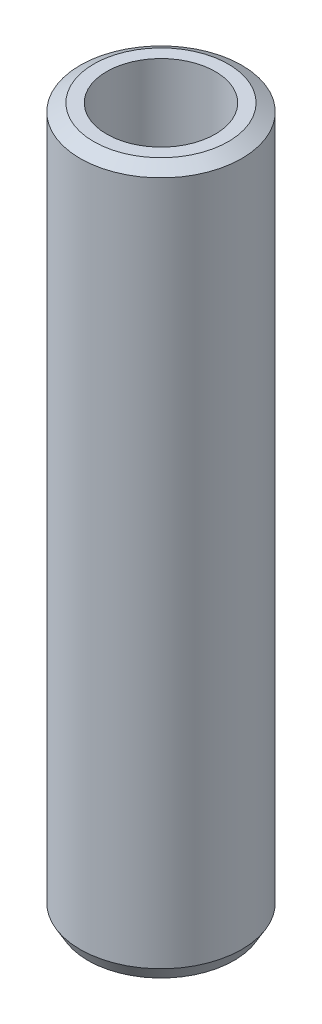
ISO-10303-21;
HEADER;
FILE_DESCRIPTION(('STEP AP214'),'2;1');
FILE_NAME('part.step','',(''),(''),'','','');
FILE_SCHEMA(('AUTOMOTIVE_DESIGN { 1 0 10303 214 1 1 1 1 }'));
ENDSEC;
DATA;
#1=APPLICATION_CONTEXT('core data for automotive mechanical design processes');
#2=APPLICATION_PROTOCOL_DEFINITION('international standard','automotive_design',2000,#1);
#3=PRODUCT_CONTEXT('',#1,'mechanical');
#4=PRODUCT('Part','Part','',(#3));
#5=PRODUCT_RELATED_PRODUCT_CATEGORY('part','',(#4));
#6=PRODUCT_DEFINITION_FORMATION('','',#4);
#7=PRODUCT_DEFINITION_CONTEXT('part definition',#1,'design');
#8=PRODUCT_DEFINITION('design','',#6,#7);
#9=PRODUCT_DEFINITION_SHAPE('','',#8);
#10=(LENGTH_UNIT() NAMED_UNIT(*) SI_UNIT(.MILLI.,.METRE.));
#11=(NAMED_UNIT(*) PLANE_ANGLE_UNIT() SI_UNIT($,.RADIAN.));
#12=(NAMED_UNIT(*) SI_UNIT($,.STERADIAN.) SOLID_ANGLE_UNIT());
#13=UNCERTAINTY_MEASURE_WITH_UNIT(LENGTH_MEASURE(1.E-05),#10,'distance_accuracy_value','');
#14=(GEOMETRIC_REPRESENTATION_CONTEXT(3) GLOBAL_UNCERTAINTY_ASSIGNED_CONTEXT((#13)) GLOBAL_UNIT_ASSIGNED_CONTEXT((#10,
#11,#12)) REPRESENTATION_CONTEXT('',''));
#15=CARTESIAN_POINT('',(0.,0.,0.));
#16=DIRECTION('',(0.,0.,1.));
#17=DIRECTION('',(1.,0.,0.));
#18=AXIS2_PLACEMENT_3D('',#15,#16,#17);
#19=CARTESIAN_POINT('',(0.,109.249292653029,0.));
#20=DIRECTION('',(0.,-1.,0.));
#21=DIRECTION('',(0.,0.,-1.));
#22=AXIS2_PLACEMENT_3D('',#19,#20,#21);
#23=CYLINDRICAL_SURFACE('',#22,12.5);
#24=CARTESIAN_POINT('',(0.,108.038825659411,0.));
#25=DIRECTION('',(0.,1.,0.));
#26=DIRECTION('',(0.,0.,1.));
#27=AXIS2_PLACEMENT_3D('',#24,#25,#26);
#28=CIRCLE('',#27,12.5);
#29=CARTESIAN_POINT('',(0.,108.038825659411,12.5));
#30=VERTEX_POINT('',#29);
#31=EDGE_CURVE('E50',#30,#30,#28,.F.);
#32=ORIENTED_EDGE('',*,*,#31,.T.);
#33=EDGE_LOOP('',(#32));
#34=FACE_BOUND('',#33,.T.);
#35=CARTESIAN_POINT('',(0.,2.09659033383197,0.));
#36=DIRECTION('',(0.,1.,0.));
#37=DIRECTION('',(0.,0.,1.));
#38=AXIS2_PLACEMENT_3D('',#35,#36,#37);
#39=CIRCLE('',#38,12.5);
#40=CARTESIAN_POINT('',(0.,2.09659033383197,12.5));
#41=VERTEX_POINT('',#40);
#42=EDGE_CURVE('E51',#41,#41,#39,.T.);
#43=ORIENTED_EDGE('',*,*,#42,.T.);
#44=EDGE_LOOP('',(#43));
#45=FACE_BOUND('',#44,.T.);
#46=ADVANCED_FACE('F39',(#34,#45),#23,.T.);
#47=CARTESIAN_POINT('',(0.,109.249292653029,0.));
#48=DIRECTION('',(0.,1.,0.));
#49=DIRECTION('',(0.,0.,1.));
#50=AXIS2_PLACEMENT_3D('',#47,#48,#49);
#51=PLANE('',#50);
#52=CARTESIAN_POINT('',(0.,109.249292653029,0.));
#53=DIRECTION('',(0.,1.,0.));
#54=DIRECTION('',(0.,0.,1.));
#55=AXIS2_PLACEMENT_3D('',#52,#53,#54);
#56=CIRCLE('',#55,10.403409666168);
#57=CARTESIAN_POINT('',(0.,109.249292653029,10.403409666168));
#58=VERTEX_POINT('',#57);
#59=EDGE_CURVE('E54',#58,#58,#56,.T.);
#60=ORIENTED_EDGE('',*,*,#59,.T.);
#61=EDGE_LOOP('',(#60));
#62=FACE_BOUND('',#61,.T.);
#63=CARTESIAN_POINT('',(0.,109.249292653029,0.));
#64=DIRECTION('',(0.,1.,0.));
#65=DIRECTION('',(0.,0.,1.));
#66=AXIS2_PLACEMENT_3D('',#63,#64,#65);
#67=CIRCLE('',#66,8.39555868896053);
#68=CARTESIAN_POINT('',(0.,109.249292653029,8.39555868896053));
#69=VERTEX_POINT('',#68);
#70=EDGE_CURVE('E58',#69,#69,#67,.T.);
#71=ORIENTED_EDGE('',*,*,#70,.F.);
#72=EDGE_LOOP('',(#71));
#73=FACE_BOUND('',#72,.T.);
#74=ADVANCED_FACE('F69',(#62,#73),#51,.T.);
#75=CARTESIAN_POINT('',(0.,0.,0.));
#76=DIRECTION('',(0.,1.,0.));
#77=DIRECTION('',(0.,0.,1.));
#78=AXIS2_PLACEMENT_3D('',#75,#76,#77);
#79=PLANE('',#78);
#80=CARTESIAN_POINT('',(0.,0.,0.));
#81=DIRECTION('',(0.,1.,0.));
#82=DIRECTION('',(0.,0.,1.));
#83=AXIS2_PLACEMENT_3D('',#80,#81,#82);
#84=CIRCLE('',#83,11.2895330063817);
#85=CARTESIAN_POINT('',(0.,0.,11.2895330063817));
#86=VERTEX_POINT('',#85);
#87=EDGE_CURVE('E10',#86,#86,#84,.F.);
#88=ORIENTED_EDGE('',*,*,#87,.T.);
#89=EDGE_LOOP('',(#88));
#90=FACE_BOUND('',#89,.T.);
#91=CARTESIAN_POINT('',(0.,0.,0.));
#92=DIRECTION('',(0.,1.,0.));
#93=DIRECTION('',(0.,0.,1.));
#94=AXIS2_PLACEMENT_3D('',#91,#92,#93);
#95=CIRCLE('',#94,8.39555868896053);
#96=CARTESIAN_POINT('',(0.,0.,8.39555868896053));
#97=VERTEX_POINT('',#96);
#98=EDGE_CURVE('E63',#97,#97,#95,.T.);
#99=ORIENTED_EDGE('',*,*,#98,.T.);
#100=EDGE_LOOP('',(#99));
#101=FACE_BOUND('',#100,.T.);
#102=ADVANCED_FACE('F75',(#90,#101),#79,.F.);
#103=CARTESIAN_POINT('',(0.,109.249292653029,0.));
#104=DIRECTION('',(0.,-1.,0.));
#105=DIRECTION('',(0.,0.,-1.));
#106=AXIS2_PLACEMENT_3D('',#103,#104,#105);
#107=CYLINDRICAL_SURFACE('',#106,8.39555868896053);
#108=ORIENTED_EDGE('',*,*,#70,.T.);
#109=EDGE_LOOP('',(#108));
#110=FACE_BOUND('',#109,.T.);
#111=ORIENTED_EDGE('',*,*,#98,.F.);
#112=EDGE_LOOP('',(#111));
#113=FACE_BOUND('',#112,.T.);
#114=ADVANCED_FACE('F70',(#110,#113),#107,.F.);
#115=CARTESIAN_POINT('',(0.,109.249292653029,0.));
#116=DIRECTION('',(0.,-1.,0.));
#117=DIRECTION('',(0.,0.,-1.));
#118=AXIS2_PLACEMENT_3D('',#115,#116,#117);
#119=CONICAL_SURFACE('',#118,10.403409666168,1.0471975511966);
#120=ORIENTED_EDGE('',*,*,#31,.F.);
#121=EDGE_LOOP('',(#120));
#122=FACE_BOUND('',#121,.T.);
#123=ORIENTED_EDGE('',*,*,#59,.F.);
#124=EDGE_LOOP('',(#123));
#125=FACE_BOUND('',#124,.T.);
#126=ADVANCED_FACE('F81',(#122,#125),#119,.T.);
#127=CARTESIAN_POINT('',(0.,2.09659033383197,0.));
#128=DIRECTION('',(0.,1.,0.));
#129=DIRECTION('',(0.,0.,1.));
#130=AXIS2_PLACEMENT_3D('',#127,#128,#129);
#131=CONICAL_SURFACE('',#130,12.5,0.523598775598303);
#132=ORIENTED_EDGE('',*,*,#87,.F.);
#133=EDGE_LOOP('',(#132));
#134=FACE_BOUND('',#133,.T.);
#135=ORIENTED_EDGE('',*,*,#42,.F.);
#136=EDGE_LOOP('',(#135));
#137=FACE_BOUND('',#136,.T.);
#138=ADVANCED_FACE('F45',(#134,#137),#131,.T.);
#139=CLOSED_SHELL('',(#46,#74,#102,#114,#126,#138));
#140=MANIFOLD_SOLID_BREP('B2',#139);
#141=ADVANCED_BREP_SHAPE_REPRESENTATION('',(#18,#140),#14);
#142=SHAPE_DEFINITION_REPRESENTATION(#9,#141);
ENDSEC;
END-ISO-10303-21;
